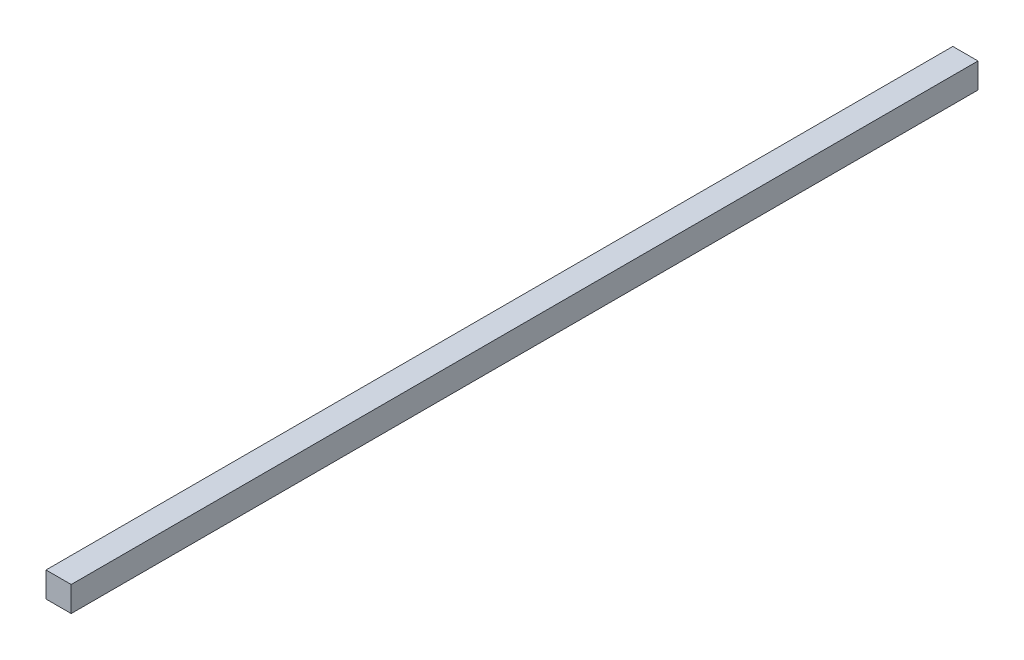
ISO-10303-21;
HEADER;
FILE_DESCRIPTION(('STEP AP214'),'2;1');
FILE_NAME('part.step','',(''),(''),'','','');
FILE_SCHEMA(('AUTOMOTIVE_DESIGN { 1 0 10303 214 1 1 1 1 }'));
ENDSEC;
DATA;
#1=APPLICATION_CONTEXT('core data for automotive mechanical design processes');
#2=APPLICATION_PROTOCOL_DEFINITION('international standard','automotive_design',2000,#1);
#3=PRODUCT_CONTEXT('',#1,'mechanical');
#4=PRODUCT('Part','Part','',(#3));
#5=PRODUCT_RELATED_PRODUCT_CATEGORY('part','',(#4));
#6=PRODUCT_DEFINITION_FORMATION('','',#4);
#7=PRODUCT_DEFINITION_CONTEXT('part definition',#1,'design');
#8=PRODUCT_DEFINITION('design','',#6,#7);
#9=PRODUCT_DEFINITION_SHAPE('','',#8);
#10=(LENGTH_UNIT() NAMED_UNIT(*) SI_UNIT(.MILLI.,.METRE.));
#11=(NAMED_UNIT(*) PLANE_ANGLE_UNIT() SI_UNIT($,.RADIAN.));
#12=(NAMED_UNIT(*) SI_UNIT($,.STERADIAN.) SOLID_ANGLE_UNIT());
#13=UNCERTAINTY_MEASURE_WITH_UNIT(LENGTH_MEASURE(1.E-05),#10,'distance_accuracy_value','');
#14=(GEOMETRIC_REPRESENTATION_CONTEXT(3) GLOBAL_UNCERTAINTY_ASSIGNED_CONTEXT((#13)) GLOBAL_UNIT_ASSIGNED_CONTEXT((#10,
#11,#12)) REPRESENTATION_CONTEXT('',''));
#15=CARTESIAN_POINT('',(0.,0.,0.));
#16=DIRECTION('',(0.,0.,1.));
#17=DIRECTION('',(1.,0.,0.));
#18=AXIS2_PLACEMENT_3D('',#15,#16,#17);
#19=CARTESIAN_POINT('',(-3.175,3.175,-304.8));
#20=DIRECTION('',(-1.,0.,0.));
#21=DIRECTION('',(0.,-1.,0.));
#22=AXIS2_PLACEMENT_3D('',#19,#20,#21);
#23=PLANE('',#22);
#24=DIRECTION('',(0.,1.,0.));
#25=VECTOR('',#24,1.);
#26=CARTESIAN_POINT('',(-3.175,3.175,-228.6));
#27=LINE('',#26,#25);
#28=CARTESIAN_POINT('',(-3.175,-3.175,-228.6));
#29=VERTEX_POINT('',#28);
#30=CARTESIAN_POINT('',(-3.175,3.175,-228.6));
#31=VERTEX_POINT('',#30);
#32=EDGE_CURVE('E74',#29,#31,#27,.T.);
#33=ORIENTED_EDGE('',*,*,#32,.F.);
#34=DIRECTION('',(0.,0.,1.));
#35=VECTOR('',#34,1.);
#36=CARTESIAN_POINT('',(-3.175,-3.175,-304.8));
#37=LINE('',#36,#35);
#38=CARTESIAN_POINT('',(-3.175,-3.175,0.));
#39=VERTEX_POINT('',#38);
#40=EDGE_CURVE('E35',#29,#39,#37,.T.);
#41=ORIENTED_EDGE('',*,*,#40,.T.);
#42=DIRECTION('',(0.,-1.,0.));
#43=VECTOR('',#42,1.);
#44=CARTESIAN_POINT('',(-3.175,3.175,0.));
#45=LINE('',#44,#43);
#46=CARTESIAN_POINT('',(-3.175,3.175,0.));
#47=VERTEX_POINT('',#46);
#48=EDGE_CURVE('E76',#47,#39,#45,.T.);
#49=ORIENTED_EDGE('',*,*,#48,.F.);
#50=DIRECTION('',(0.,0.,1.));
#51=VECTOR('',#50,1.);
#52=CARTESIAN_POINT('',(-3.175,3.175,-304.8));
#53=LINE('',#52,#51);
#54=EDGE_CURVE('E11',#31,#47,#53,.T.);
#55=ORIENTED_EDGE('',*,*,#54,.F.);
#56=EDGE_LOOP('',(#33,#41,#49,#55));
#57=FACE_BOUND('',#56,.T.);
#58=ADVANCED_FACE('F32',(#57),#23,.T.);
#59=CARTESIAN_POINT('',(-3.175,3.175,-304.8));
#60=DIRECTION('',(0.,1.,0.));
#61=DIRECTION('',(0.,0.,1.));
#62=AXIS2_PLACEMENT_3D('',#59,#60,#61);
#63=PLANE('',#62);
#64=DIRECTION('',(-1.,0.,0.));
#65=VECTOR('',#64,1.);
#66=CARTESIAN_POINT('',(3.175,3.175,-228.6));
#67=LINE('',#66,#65);
#68=CARTESIAN_POINT('',(3.175,3.175,-228.6));
#69=VERTEX_POINT('',#68);
#70=EDGE_CURVE('E71',#69,#31,#67,.T.);
#71=ORIENTED_EDGE('',*,*,#70,.T.);
#72=ORIENTED_EDGE('',*,*,#54,.T.);
#73=DIRECTION('',(-1.,0.,0.));
#74=VECTOR('',#73,1.);
#75=CARTESIAN_POINT('',(-3.175,3.175,0.));
#76=LINE('',#75,#74);
#77=CARTESIAN_POINT('',(3.175,3.175,0.));
#78=VERTEX_POINT('',#77);
#79=EDGE_CURVE('E88',#78,#47,#76,.T.);
#80=ORIENTED_EDGE('',*,*,#79,.F.);
#81=DIRECTION('',(0.,0.,1.));
#82=VECTOR('',#81,1.);
#83=CARTESIAN_POINT('',(3.175,3.175,-304.8));
#84=LINE('',#83,#82);
#85=EDGE_CURVE('E40',#69,#78,#84,.T.);
#86=ORIENTED_EDGE('',*,*,#85,.F.);
#87=EDGE_LOOP('',(#71,#72,#80,#86));
#88=FACE_BOUND('',#87,.T.);
#89=ADVANCED_FACE('F86',(#88),#63,.T.);
#90=CARTESIAN_POINT('',(3.175,3.175,-304.8));
#91=DIRECTION('',(1.,0.,0.));
#92=DIRECTION('',(0.,1.,0.));
#93=AXIS2_PLACEMENT_3D('',#90,#91,#92);
#94=PLANE('',#93);
#95=DIRECTION('',(0.,1.,0.));
#96=VECTOR('',#95,1.);
#97=CARTESIAN_POINT('',(3.175,3.175,-228.6));
#98=LINE('',#97,#96);
#99=CARTESIAN_POINT('',(3.175,-3.175,-228.6));
#100=VERTEX_POINT('',#99);
#101=EDGE_CURVE('E48',#100,#69,#98,.T.);
#102=ORIENTED_EDGE('',*,*,#101,.T.);
#103=ORIENTED_EDGE('',*,*,#85,.T.);
#104=DIRECTION('',(0.,1.,0.));
#105=VECTOR('',#104,1.);
#106=CARTESIAN_POINT('',(3.175,3.175,0.));
#107=LINE('',#106,#105);
#108=CARTESIAN_POINT('',(3.175,-3.175,0.));
#109=VERTEX_POINT('',#108);
#110=EDGE_CURVE('E92',#109,#78,#107,.T.);
#111=ORIENTED_EDGE('',*,*,#110,.F.);
#112=DIRECTION('',(0.,0.,1.));
#113=VECTOR('',#112,1.);
#114=CARTESIAN_POINT('',(3.175,-3.175,-304.8));
#115=LINE('',#114,#113);
#116=EDGE_CURVE('E84',#100,#109,#115,.T.);
#117=ORIENTED_EDGE('',*,*,#116,.F.);
#118=EDGE_LOOP('',(#102,#103,#111,#117));
#119=FACE_BOUND('',#118,.T.);
#120=ADVANCED_FACE('F81',(#119),#94,.T.);
#121=CARTESIAN_POINT('',(-3.175,-3.175,-304.8));
#122=DIRECTION('',(0.,-1.,0.));
#123=DIRECTION('',(0.,0.,-1.));
#124=AXIS2_PLACEMENT_3D('',#121,#122,#123);
#125=PLANE('',#124);
#126=DIRECTION('',(-1.,0.,0.));
#127=VECTOR('',#126,1.);
#128=CARTESIAN_POINT('',(3.175,-3.175,-228.6));
#129=LINE('',#128,#127);
#130=EDGE_CURVE('E77',#100,#29,#129,.T.);
#131=ORIENTED_EDGE('',*,*,#130,.F.);
#132=ORIENTED_EDGE('',*,*,#116,.T.);
#133=DIRECTION('',(1.,0.,0.));
#134=VECTOR('',#133,1.);
#135=CARTESIAN_POINT('',(-3.175,-3.175,0.));
#136=LINE('',#135,#134);
#137=EDGE_CURVE('E94',#39,#109,#136,.T.);
#138=ORIENTED_EDGE('',*,*,#137,.F.);
#139=ORIENTED_EDGE('',*,*,#40,.F.);
#140=EDGE_LOOP('',(#131,#132,#138,#139));
#141=FACE_BOUND('',#140,.T.);
#142=ADVANCED_FACE('F104',(#141),#125,.T.);
#143=CARTESIAN_POINT('',(-3.175,-3.175,0.));
#144=DIRECTION('',(0.,0.,1.));
#145=DIRECTION('',(1.,0.,0.));
#146=AXIS2_PLACEMENT_3D('',#143,#144,#145);
#147=PLANE('',#146);
#148=ORIENTED_EDGE('',*,*,#48,.T.);
#149=ORIENTED_EDGE('',*,*,#137,.T.);
#150=ORIENTED_EDGE('',*,*,#110,.T.);
#151=ORIENTED_EDGE('',*,*,#79,.T.);
#152=EDGE_LOOP('',(#148,#149,#150,#151));
#153=FACE_BOUND('',#152,.T.);
#154=ADVANCED_FACE('F106',(#153),#147,.T.);
#155=CARTESIAN_POINT('',(3.175,3.175,-228.6));
#156=DIRECTION('',(0.,0.,1.));
#157=DIRECTION('',(1.,0.,0.));
#158=AXIS2_PLACEMENT_3D('',#155,#156,#157);
#159=PLANE('',#158);
#160=ORIENTED_EDGE('',*,*,#32,.T.);
#161=ORIENTED_EDGE('',*,*,#70,.F.);
#162=ORIENTED_EDGE('',*,*,#101,.F.);
#163=ORIENTED_EDGE('',*,*,#130,.T.);
#164=EDGE_LOOP('',(#160,#161,#162,#163));
#165=FACE_BOUND('',#164,.T.);
#166=ADVANCED_FACE('F72',(#165),#159,.F.);
#167=CLOSED_SHELL('',(#58,#89,#120,#142,#154,#166));
#168=MANIFOLD_SOLID_BREP('B2',#167);
#169=ADVANCED_BREP_SHAPE_REPRESENTATION('',(#18,#168),#14);
#170=SHAPE_DEFINITION_REPRESENTATION(#9,#169);
ENDSEC;
END-ISO-10303-21;
